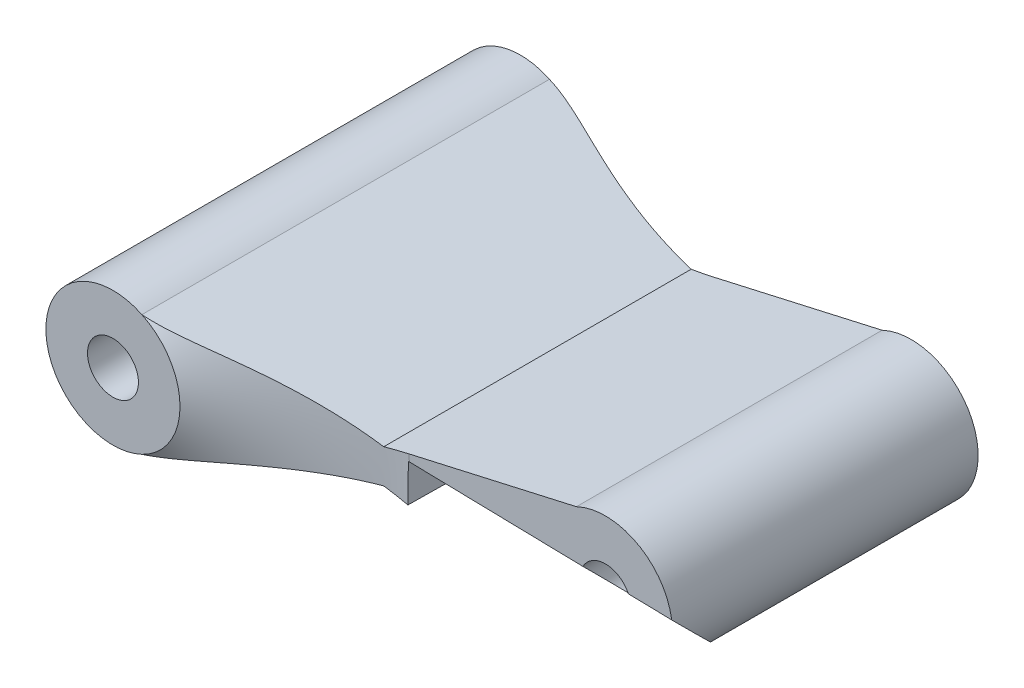
ISO-10303-21;
HEADER;
FILE_DESCRIPTION(('STEP AP214'),'2;1');
FILE_NAME('part.step','',(''),(''),'','','');
FILE_SCHEMA(('AUTOMOTIVE_DESIGN { 1 0 10303 214 1 1 1 1 }'));
ENDSEC;
DATA;
#1=APPLICATION_CONTEXT('core data for automotive mechanical design processes');
#2=APPLICATION_PROTOCOL_DEFINITION('international standard','automotive_design',2000,#1);
#3=PRODUCT_CONTEXT('',#1,'mechanical');
#4=PRODUCT('Part','Part','',(#3));
#5=PRODUCT_RELATED_PRODUCT_CATEGORY('part','',(#4));
#6=PRODUCT_DEFINITION_FORMATION('','',#4);
#7=PRODUCT_DEFINITION_CONTEXT('part definition',#1,'design');
#8=PRODUCT_DEFINITION('design','',#6,#7);
#9=PRODUCT_DEFINITION_SHAPE('','',#8);
#10=(LENGTH_UNIT() NAMED_UNIT(*) SI_UNIT(.MILLI.,.METRE.));
#11=(NAMED_UNIT(*) PLANE_ANGLE_UNIT() SI_UNIT($,.RADIAN.));
#12=(NAMED_UNIT(*) SI_UNIT($,.STERADIAN.) SOLID_ANGLE_UNIT());
#13=UNCERTAINTY_MEASURE_WITH_UNIT(LENGTH_MEASURE(1.E-05),#10,'distance_accuracy_value','');
#14=(GEOMETRIC_REPRESENTATION_CONTEXT(3) GLOBAL_UNCERTAINTY_ASSIGNED_CONTEXT((#13)) GLOBAL_UNIT_ASSIGNED_CONTEXT((#10,
#11,#12)) REPRESENTATION_CONTEXT('',''));
#15=CARTESIAN_POINT('',(0.,0.,0.));
#16=DIRECTION('',(0.,0.,1.));
#17=DIRECTION('',(1.,0.,0.));
#18=AXIS2_PLACEMENT_3D('',#15,#16,#17);
#19=CARTESIAN_POINT('',(0.318319944851648,1.40276585866828,9.));
#20=DIRECTION('',(-0.221296857654929,-0.975206491360704,0.));
#21=DIRECTION('',(0.975206491360704,-0.221296857654929,0.));
#22=AXIS2_PLACEMENT_3D('',#19,#20,#21);
#23=PLANE('',#22);
#24=DIRECTION('',(0.956277357625722,-0.217001400384298,-0.196071434746678));
#25=VECTOR('',#24,1.);
#26=CARTESIAN_POINT('',(0.372273808808155,1.39052248184738,9.27669348390134));
#27=LINE('',#26,#25);
#28=CARTESIAN_POINT('',(7.1979587305178,-0.158382942694425,7.87718127642713));
#29=VERTEX_POINT('',#28);
#30=CARTESIAN_POINT('',(12.1475499781939,-1.28155941812862,6.8623361066628));
#31=VERTEX_POINT('',#30);
#32=EDGE_CURVE('E310',#29,#31,#27,.T.);
#33=ORIENTED_EDGE('',*,*,#32,.F.);
#34=DIRECTION('',(-0.0108913560744962,0.00247150003228952,0.999937633080408));
#35=VECTOR('',#34,1.);
#36=CARTESIAN_POINT('',(7.18487237767981,-0.155413347242726,9.0786420121679));
#37=LINE('',#36,#35);
#38=CARTESIAN_POINT('',(7.18572854478782,-0.155607631317236,9.00003713453392));
#39=VERTEX_POINT('',#38);
#40=EDGE_CURVE('E133',#29,#39,#37,.T.);
#41=ORIENTED_EDGE('',*,*,#40,.T.);
#42=CARTESIAN_POINT('',(7.21253809260097,-0.161691336397913,9.));
#43=CARTESIAN_POINT('',(7.09362902021836,-0.134708123818783,9.00000580370716));
#44=CARTESIAN_POINT('',(6.97479628908164,-0.107742234830064,9.00219337229599));
#45=CARTESIAN_POINT('',(6.73728359165386,-0.0538451227214536,9.01093203620697));
#46=CARTESIAN_POINT('',(6.61860362525693,-0.0269138995775347,9.01748312850315));
#47=CARTESIAN_POINT('',(6.5,0.,9.02621598265502));
#48=B_SPLINE_CURVE_WITH_KNOTS('',3,(#42,#43,#44,#45,#46,#47),.UNSPECIFIED.,.F.,.F.,(4,2,4),(0.,
0.365620655231985,0.73124105691725),.UNSPECIFIED.);
#49=CARTESIAN_POINT('',(6.5,0.,9.02621598265502));
#50=VERTEX_POINT('',#49);
#51=EDGE_CURVE('E138',#39,#50,#48,.T.);
#52=ORIENTED_EDGE('',*,*,#51,.T.);
#53=DIRECTION('',(0.,0.,-1.));
#54=VECTOR('',#53,1.);
#55=CARTESIAN_POINT('',(6.5,0.,9.));
#56=LINE('',#55,#54);
#57=CARTESIAN_POINT('',(6.5,0.,-0.0262159826550194));
#58=VERTEX_POINT('',#57);
#59=EDGE_CURVE('E64',#50,#58,#56,.T.);
#60=ORIENTED_EDGE('',*,*,#59,.T.);
#61=CARTESIAN_POINT('',(6.5,0.,-0.0262159826550194));
#62=CARTESIAN_POINT('',(6.61860362525693,-0.0269138995775348,-0.0174831285031518));
#63=CARTESIAN_POINT('',(6.73728359165386,-0.0538451227214539,-0.0109320362069728));
#64=CARTESIAN_POINT('',(6.97479628908164,-0.107742234830065,-0.00219337229599346));
#65=CARTESIAN_POINT('',(7.09362902021837,-0.134708123818784,-5.80370716617859E-06));
#66=CARTESIAN_POINT('',(7.21253809260098,-0.161691336397914,0.));
#67=B_SPLINE_CURVE_WITH_KNOTS('',3,(#61,#62,#63,#64,#65,#66),.UNSPECIFIED.,.F.,.F.,(4,2,4),(0.,
0.365620401685268,0.731241056917255),.UNSPECIFIED.);
#68=CARTESIAN_POINT('',(7.21253809260098,-0.161691336397914,0.));
#69=VERTEX_POINT('',#68);
#70=EDGE_CURVE('E129',#58,#69,#67,.T.);
#71=ORIENTED_EDGE('',*,*,#70,.T.);
#72=DIRECTION('',(-0.975206491360704,0.221296857654929,0.));
#73=VECTOR('',#72,1.);
#74=CARTESIAN_POINT('',(0.318319944851648,1.40276585866828,0.));
#75=LINE('',#74,#73);
#76=CARTESIAN_POINT('',(12.1475499781939,-1.28155941812862,0.));
#77=VERTEX_POINT('',#76);
#78=EDGE_CURVE('E249',#77,#69,#75,.T.);
#79=ORIENTED_EDGE('',*,*,#78,.F.);
#80=DIRECTION('',(0.,0.,-1.));
#81=VECTOR('',#80,1.);
#82=CARTESIAN_POINT('',(12.1475499781939,-1.28155941812862,9.));
#83=LINE('',#82,#81);
#84=EDGE_CURVE('E276',#31,#77,#83,.T.);
#85=ORIENTED_EDGE('',*,*,#84,.F.);
#86=EDGE_LOOP('',(#33,#41,#52,#60,#71,#79,#85));
#87=FACE_BOUND('',#86,.T.);
#88=ADVANCED_FACE('F36',(#87),#23,.T.);
#89=CARTESIAN_POINT('',(0.,0.5,19.));
#90=DIRECTION('',(0.,0.,1.));
#91=DIRECTION('',(1.,0.,0.));
#92=AXIS2_PLACEMENT_3D('',#89,#90,#91);
#93=DEGENERATE_TOROIDAL_SURFACE('',#92,7.24282687642637,10.,.T.);
#94=CARTESIAN_POINT('',(7.1981587305178,0.983065076575513,9.00004054768263));
#95=CARTESIAN_POINT('',(7.19687752300153,0.865729791494417,9.00007048954901));
#96=CARTESIAN_POINT('',(7.19559635811303,0.748394489925287,9.00009651093696));
#97=CARTESIAN_POINT('',(7.19303426030841,0.513723966671679,9.00012738877503));
#98=CARTESIAN_POINT('',(7.19175332739212,0.396388744987204,9.00013224524045));
#99=CARTESIAN_POINT('',(7.18791109951056,0.0443836287972611,9.00009508143548));
#100=CARTESIAN_POINT('',(7.18535036979757,-0.19028623096475,9.00000132821181));
#101=CARTESIAN_POINT('',(7.18022687238521,-0.659627693542403,8.99999872471738));
#102=CARTESIAN_POINT('',(7.17766410467324,-0.894299296359792,9.00008987559906));
#103=CARTESIAN_POINT('',(7.17381212510018,-1.24630567003786,9.00094454704455));
#104=CARTESIAN_POINT('',(7.17252682543514,-1.36364112058816,9.00134909611676));
#105=CARTESIAN_POINT('',(7.16995215983244,-1.59831065674907,9.00253196168537));
#106=CARTESIAN_POINT('',(7.16866279387282,-1.71564474234885,9.00331028020443));
#107=CARTESIAN_POINT('',(7.16737067264849,-1.83297705458006,9.00434270800302));
#108=B_SPLINE_CURVE_WITH_KNOTS('',3,(#94,#95,#96,#97,#98,#99,#100,#101,#102,#103,#104,#105,#106,
#107),.UNSPECIFIED.,.F.,.F.,(4,2,2,2,2,2,4),(0.,0.352026879737172,0.704053505084873,
1.40810521332883,2.11216130971417,2.46419034446983,2.81622128427568),.UNSPECIFIED.);
#109=CARTESIAN_POINT('',(7.1979587305178,0.964748136813708,9.00004464121841));
#110=VERTEX_POINT('',#109);
#111=EDGE_CURVE('E11',#110,#39,#108,.T.);
#112=ORIENTED_EDGE('',*,*,#111,.F.);
#113=CARTESIAN_POINT('',(7.1977587305178,0.964753101955966,9.00004523861132));
#114=CARTESIAN_POINT('',(7.20530302589269,0.964565730857076,9.00002262548714));
#115=CARTESIAN_POINT('',(7.21284751907229,0.964386835374219,9.00000849027735));
#116=CARTESIAN_POINT('',(7.22793690104181,0.964045995640552,8.99999717568651));
#117=CARTESIAN_POINT('',(7.23548178983173,0.963884051389745,8.99999999630548));
#118=CARTESIAN_POINT('',(7.24302687642636,0.963730582754973,9.00001129483884));
#119=B_SPLINE_CURVE_WITH_KNOTS('',3,(#113,#114,#115,#116,#117,#118),.UNSPECIFIED.,.F.,.F.,(4,2,
4),(0.,0.0226398813295181,0.0452797626617358),.UNSPECIFIED.);
#120=CARTESIAN_POINT('',(7.22794576859043,0.964048626977582,9.));
#121=VERTEX_POINT('',#120);
#122=EDGE_CURVE('E49',#110,#121,#119,.T.);
#123=ORIENTED_EDGE('',*,*,#122,.T.);
#124=CARTESIAN_POINT('',(0.,0.5,9.));
#125=DIRECTION('',(0.,0.,1.));
#126=DIRECTION('',(1.,0.,0.));
#127=AXIS2_PLACEMENT_3D('',#124,#125,#126);
#128=CIRCLE('',#127,7.24282687642637);
#129=CARTESIAN_POINT('',(7.21253809260097,1.16169133639791,9.));
#130=VERTEX_POINT('',#129);
#131=EDGE_CURVE('E277',#130,#121,#128,.F.);
#132=ORIENTED_EDGE('',*,*,#131,.F.);
#133=CARTESIAN_POINT('',(6.5,0.999999999999998,9.02621598265502));
#134=CARTESIAN_POINT('',(6.61860362525693,1.02691389957753,9.01748312850315));
#135=CARTESIAN_POINT('',(6.73728359165386,1.05384512272145,9.01093203620697));
#136=CARTESIAN_POINT('',(6.97479628908164,1.10774223483006,9.00219337229599));
#137=CARTESIAN_POINT('',(7.09362902021836,1.13470812381878,9.00000580370716));
#138=CARTESIAN_POINT('',(7.21253809260097,1.16169133639791,9.));
#139=B_SPLINE_CURVE_WITH_KNOTS('',3,(#133,#134,#135,#136,#137,#138),.UNSPECIFIED.,.F.,.F.,(4,2,
4),(0.,0.365620401685265,0.73124105691725),.UNSPECIFIED.);
#140=CARTESIAN_POINT('',(6.5,0.999999999999999,9.02621598265502));
#141=VERTEX_POINT('',#140);
#142=EDGE_CURVE('E142',#141,#130,#139,.T.);
#143=ORIENTED_EDGE('',*,*,#142,.F.);
#144=CARTESIAN_POINT('',(0.852450021806109,2.28155941812861,10.5));
#145=CARTESIAN_POINT('',(0.93067139855769,2.26380918263499,10.489013320175));
#146=CARTESIAN_POINT('',(1.00845661573879,2.24615792181312,10.4752526889548));
#147=CARTESIAN_POINT('',(1.16304295947348,2.21107871304256,10.4432612052944));
#148=CARTESIAN_POINT('',(1.23984532344939,2.19365048429418,10.4250367097688));
#149=CARTESIAN_POINT('',(1.3922525573757,2.15906576582628,10.3852424649759));
#150=CARTESIAN_POINT('',(1.46786111939392,2.14190843829138,10.3636871978769));
#151=CARTESIAN_POINT('',(1.61839367035508,2.10774912865019,10.3181132888547));
#152=CARTESIAN_POINT('',(1.69331737882604,2.09074721018948,10.2940936829531));
#153=CARTESIAN_POINT('',(1.84242671802539,2.05691086014039,10.2444596039148));
#154=CARTESIAN_POINT('',(1.91661381271166,2.0400760963462,10.2188497028417));
#155=CARTESIAN_POINT('',(2.06464535783512,2.00648432264511,10.1666050123969));
#156=CARTESIAN_POINT('',(2.13848979238746,1.98972731634284,10.1399701760335));
#157=CARTESIAN_POINT('',(2.35997099872252,1.93946811952066,10.0592404408675));
#158=CARTESIAN_POINT('',(2.50734466318215,1.90602563412405,10.0043940216295));
#159=CARTESIAN_POINT('',(2.81015004351038,1.8373121055111,9.8927741900865));
#160=CARTESIAN_POINT('',(2.96559934775443,1.80203707108649,9.83605039886547));
#161=CARTESIAN_POINT('',(3.27756324862492,1.73124526281204,9.72575799777402));
#162=CARTESIAN_POINT('',(3.43407779120428,1.69572850122672,9.67218922913877));
#163=CARTESIAN_POINT('',(3.74832170951535,1.62441930437921,9.56969798683157));
#164=CARTESIAN_POINT('',(3.90604912240243,1.58862731453176,9.52076923524955));
#165=CARTESIAN_POINT('',(4.22303860274746,1.51669508629961,9.42846161269146));
#166=CARTESIAN_POINT('',(4.38230056499298,1.48055487179005,9.38508236409881));
#167=CARTESIAN_POINT('',(4.70254357669775,1.40788434221089,9.3045271619748));
#168=CARTESIAN_POINT('',(4.86352664691574,1.3713535685845,9.26735961417284));
#169=CARTESIAN_POINT('',(5.18684067684732,1.29798615410003,9.19982970867943));
#170=CARTESIAN_POINT('',(5.34917156318563,1.26114952989249,9.16946698301926));
#171=CARTESIAN_POINT('',(5.67575568761394,1.18704005550299,9.11581984356914));
#172=CARTESIAN_POINT('',(5.84001443160003,1.14976595590615,9.09257049329455));
#173=CARTESIAN_POINT('',(6.16942266715319,1.07501562553062,9.05363961691235));
#174=CARTESIAN_POINT('',(6.33457237269373,1.03753934619642,9.03795999877383));
#175=CARTESIAN_POINT('',(6.5,0.999999999999998,9.02621598265502));
#176=B_SPLINE_CURVE_WITH_KNOTS('',3,(#144,#145,#146,#147,#148,#149,#150,#151,#152,#153,#154,
#155,#156,#157,#158,#159,#160,#161,#162,#163,#164,#165,#166,#167,#168,#169,#170,#171,#172,#173,
#174,#175),.UNSPECIFIED.,.F.,.F.,(4,2,2,2,2,2,2,2,2,2,2,2,2,2,2,4),(0.,0.242733041900916,
0.485122401237104,0.7264860618196,0.967944499523185,1.20873829314252,1.44954314000396,
1.93183849596756,2.43940618117452,2.94694830305916,3.45379362250529,3.9606044352365,
4.46809561125668,4.97555933821833,5.48548560610094,5.99554033510277),.UNSPECIFIED.);
#177=CARTESIAN_POINT('',(0.852450021806109,2.28155941812861,10.5));
#178=VERTEX_POINT('',#177);
#179=EDGE_CURVE('E146',#178,#141,#176,.T.);
#180=ORIENTED_EDGE('',*,*,#179,.F.);
#181=CARTESIAN_POINT('',(0.,0.5,10.5));
#182=DIRECTION('',(0.,0.,1.));
#183=DIRECTION('',(1.,0.,0.));
#184=AXIS2_PLACEMENT_3D('',#181,#182,#183);
#185=CIRCLE('',#184,1.975);
#186=CARTESIAN_POINT('',(0.852450021806107,-1.28155941812861,10.5));
#187=VERTEX_POINT('',#186);
#188=EDGE_CURVE('E305',#187,#178,#185,.T.);
#189=ORIENTED_EDGE('',*,*,#188,.F.);
#190=CARTESIAN_POINT('',(6.5,0.,9.02621598265502));
#191=CARTESIAN_POINT('',(6.28388283576225,-0.0490419718847199,9.04153239081206));
#192=CARTESIAN_POINT('',(6.06826005973863,-0.0979717556746956,9.06360237120793));
#193=CARTESIAN_POINT('',(5.63858914168239,-0.19547400246438,9.12051815873685));
#194=CARTESIAN_POINT('',(5.42454120992051,-0.244046417748808,9.15536564142121));
#195=CARTESIAN_POINT('',(4.99938133302807,-0.340525005197476,9.23696282180518));
#196=CARTESIAN_POINT('',(4.78826191846441,-0.388432872348461,9.2836719638422));
#197=CARTESIAN_POINT('',(4.36866504364752,-0.483649086249216,9.38791847478578));
#198=CARTESIAN_POINT('',(4.16018680298897,-0.530957610090966,9.44545256157841));
#199=CARTESIAN_POINT('',(3.82363899823332,-0.607328073477823,9.54637852879663));
#200=CARTESIAN_POINT('',(3.69475834652267,-0.636574067519855,9.58697349255897));
#201=CARTESIAN_POINT('',(3.43794128515926,-0.694851785290784,9.67116479734663));
#202=CARTESIAN_POINT('',(3.31000483159243,-0.723883518984794,9.71476099779983));
#203=CARTESIAN_POINT('',(3.05486644111806,-0.78178030759244,9.80419934246881));
#204=CARTESIAN_POINT('',(2.9276646127107,-0.810645337884879,9.85004180941911));
#205=CARTESIAN_POINT('',(2.67363737498903,-0.868289980290952,9.94291378560176));
#206=CARTESIAN_POINT('',(2.54681208376513,-0.897069565607144,9.98994363065588));
#207=CARTESIAN_POINT('',(2.29194106176569,-0.954905682137786,10.0840523356766));
#208=CARTESIAN_POINT('',(2.16389422448594,-0.983962464443576,10.1311281315128));
#209=CARTESIAN_POINT('',(1.90699322881179,-1.04225922884656,10.2225599270788));
#210=CARTESIAN_POINT('',(1.77813987219392,-1.07149902900215,10.2669182637699));
#211=CARTESIAN_POINT('',(1.51826805670794,-1.13046994097781,10.3495986727011));
#212=CARTESIAN_POINT('',(1.38724625760249,-1.16020181077482,10.3879102404606));
#213=CARTESIAN_POINT('',(1.1885167752113,-1.20529811639436,10.437154775274));
#214=CARTESIAN_POINT('',(1.121798917167,-1.22043793802749,10.4522166369433));
#215=CARTESIAN_POINT('',(0.987643907184533,-1.25088080567736,10.4788836712219));
#216=CARTESIAN_POINT('',(0.920206086383874,-1.26618400347443,10.4904852748286));
#217=CARTESIAN_POINT('',(0.852450021806106,-1.28155941812861,10.5));
#218=B_SPLINE_CURVE_WITH_KNOTS('',3,(#190,#191,#192,#193,#194,#195,#196,#197,#198,#199,#200,
#201,#202,#203,#204,#205,#206,#207,#208,#209,#210,#211,#212,#213,#214,#215,#216,#217),
.UNSPECIFIED.,.F.,.F.,(4,2,2,2,2,2,2,2,2,2,2,2,2,4),(0.,0.666260771203592,1.33260894239821,
1.99670880601756,2.66060763866727,3.07532682935553,3.49002660859863,3.90478614594977,
4.31966433218776,4.73811447111591,5.15619954785824,5.57500311455566,5.78507852978281,
5.9953698789855),.UNSPECIFIED.);
#219=EDGE_CURVE('E141',#50,#187,#218,.T.);
#220=ORIENTED_EDGE('',*,*,#219,.F.);
#221=ORIENTED_EDGE('',*,*,#51,.F.);
#222=EDGE_LOOP('',(#112,#123,#132,#143,#180,#189,#220,#221));
#223=FACE_BOUND('',#222,.T.);
#224=ADVANCED_FACE('F136',(#223),#93,.F.);
#225=CARTESIAN_POINT('',(13.,0.5,9.));
#226=DIRECTION('',(0.,0.,-1.));
#227=DIRECTION('',(-1.,0.,0.));
#228=AXIS2_PLACEMENT_3D('',#225,#226,#227);
#229=CYLINDRICAL_SURFACE('',#228,1.97499999999999);
#230=CARTESIAN_POINT('',(13.,0.5,9.));
#231=DIRECTION('',(0.,0.,1.));
#232=DIRECTION('',(1.,0.,0.));
#233=AXIS2_PLACEMENT_3D('',#230,#231,#232);
#234=CIRCLE('',#233,1.97499999999999);
#235=CARTESIAN_POINT('',(14.9527906926657,0.795353196424537,9.));
#236=VERTEX_POINT('',#235);
#237=CARTESIAN_POINT('',(12.1475499781939,2.28155941812862,9.));
#238=VERTEX_POINT('',#237);
#239=EDGE_CURVE('E262',#236,#238,#234,.T.);
#240=ORIENTED_EDGE('',*,*,#239,.F.);
#241=CARTESIAN_POINT('',(13.,0.5,8.6620822597468));
#242=DIRECTION('',(0.0154381415529362,0.706938231944909,-0.707106781186545));
#243=DIRECTION('',(-0.0154381415529361,-0.706938231944905,-0.70710678118655));
#244=AXIS2_PLACEMENT_3D('',#241,#242,#243);
#245=ELLIPSE('',#244,2.79307178568686,1.97499999999999);
#246=EDGE_CURVE('E312',#236,#31,#245,.T.);
#247=ORIENTED_EDGE('',*,*,#246,.T.);
#248=ORIENTED_EDGE('',*,*,#84,.T.);
#249=CARTESIAN_POINT('',(13.,0.5,0.));
#250=DIRECTION('',(0.,0.,1.));
#251=DIRECTION('',(1.,0.,0.));
#252=AXIS2_PLACEMENT_3D('',#249,#250,#251);
#253=CIRCLE('',#252,1.97499999999999);
#254=CARTESIAN_POINT('',(12.1475499781939,2.28155941812862,0.));
#255=VERTEX_POINT('',#254);
#256=EDGE_CURVE('E259',#77,#255,#253,.T.);
#257=ORIENTED_EDGE('',*,*,#256,.T.);
#258=DIRECTION('',(0.,0.,-1.));
#259=VECTOR('',#258,1.);
#260=CARTESIAN_POINT('',(12.1475499781939,2.28155941812862,9.));
#261=LINE('',#260,#259);
#262=EDGE_CURVE('E256',#238,#255,#261,.T.);
#263=ORIENTED_EDGE('',*,*,#262,.F.);
#264=EDGE_LOOP('',(#240,#247,#248,#257,#263));
#265=FACE_BOUND('',#264,.T.);
#266=ADVANCED_FACE('F167',(#265),#229,.T.);
#267=CARTESIAN_POINT('',(0.102509812748837,-0.451738157876229,9.));
#268=DIRECTION('',(-0.221296857654929,0.975206491360704,0.));
#269=DIRECTION('',(-0.975206491360704,-0.221296857654929,0.));
#270=AXIS2_PLACEMENT_3D('',#267,#268,#269);
#271=PLANE('',#270);
#272=DIRECTION('',(0.975206491360704,0.221296857654929,0.));
#273=VECTOR('',#272,1.);
#274=CARTESIAN_POINT('',(0.102509812748837,-0.451738157876229,0.));
#275=LINE('',#274,#273);
#276=CARTESIAN_POINT('',(7.21253809260098,1.16169133639791,0.));
#277=VERTEX_POINT('',#276);
#278=EDGE_CURVE('E246',#277,#255,#275,.T.);
#279=ORIENTED_EDGE('',*,*,#278,.F.);
#280=CARTESIAN_POINT('',(7.21253809260098,1.16169133639791,0.));
#281=CARTESIAN_POINT('',(7.09362902021837,1.13470812381878,-5.80370716557285E-06));
#282=CARTESIAN_POINT('',(6.97479628908164,1.10774223483006,-0.00219337229599296));
#283=CARTESIAN_POINT('',(6.73728359165386,1.05384512272145,-0.0109320362069725));
#284=CARTESIAN_POINT('',(6.61860362525693,1.02691389957753,-0.0174831285031516));
#285=CARTESIAN_POINT('',(6.5,0.999999999999998,-0.0262159826550194));
#286=B_SPLINE_CURVE_WITH_KNOTS('',3,(#280,#281,#282,#283,#284,#285),.UNSPECIFIED.,.F.,.F.,(4,2,
4),(0.,0.365620655231987,0.731241056917255),.UNSPECIFIED.);
#287=CARTESIAN_POINT('',(6.5,0.999999999999999,-0.0262159826550194));
#288=VERTEX_POINT('',#287);
#289=EDGE_CURVE('E235',#277,#288,#286,.T.);
#290=ORIENTED_EDGE('',*,*,#289,.T.);
#291=DIRECTION('',(0.,0.,-1.));
#292=VECTOR('',#291,1.);
#293=CARTESIAN_POINT('',(6.5,0.999999999999999,9.));
#294=LINE('',#293,#292);
#295=EDGE_CURVE('E273',#141,#288,#294,.T.);
#296=ORIENTED_EDGE('',*,*,#295,.F.);
#297=ORIENTED_EDGE('',*,*,#142,.T.);
#298=DIRECTION('',(0.975206491360704,0.221296857654929,0.));
#299=VECTOR('',#298,1.);
#300=CARTESIAN_POINT('',(0.102509812748837,-0.451738157876229,9.));
#301=LINE('',#300,#299);
#302=EDGE_CURVE('E269',#130,#238,#301,.T.);
#303=ORIENTED_EDGE('',*,*,#302,.T.);
#304=ORIENTED_EDGE('',*,*,#262,.T.);
#305=EDGE_LOOP('',(#279,#290,#296,#297,#303,#304));
#306=FACE_BOUND('',#305,.T.);
#307=ADVANCED_FACE('F221',(#306),#271,.T.);
#308=CARTESIAN_POINT('',(0.534130076954461,2.35379355946033,9.));
#309=DIRECTION('',(0.221296857654929,0.975206491360704,0.));
#310=DIRECTION('',(-0.975206491360704,0.221296857654929,0.));
#311=AXIS2_PLACEMENT_3D('',#308,#309,#310);
#312=PLANE('',#311);
#313=ORIENTED_EDGE('',*,*,#295,.T.);
#314=CARTESIAN_POINT('',(6.5,0.999999999999998,-0.0262159826550195));
#315=CARTESIAN_POINT('',(6.28388283576225,1.04904197188472,-0.0415323908120649));
#316=CARTESIAN_POINT('',(6.06826005973863,1.09797175567469,-0.0636023712079342));
#317=CARTESIAN_POINT('',(5.63858914168239,1.19547400246438,-0.12051815873685));
#318=CARTESIAN_POINT('',(5.42454120992051,1.24404641774881,-0.155365641421206));
#319=CARTESIAN_POINT('',(4.99938133302807,1.34052500519747,-0.236962821805178));
#320=CARTESIAN_POINT('',(4.78826191846441,1.38843287234846,-0.2836719638422));
#321=CARTESIAN_POINT('',(4.36866504364752,1.48364908624921,-0.387918474785779));
#322=CARTESIAN_POINT('',(4.16018680298897,1.53095761009096,-0.445452561578415));
#323=CARTESIAN_POINT('',(3.82363899823332,1.60732807347782,-0.546378528796633));
#324=CARTESIAN_POINT('',(3.69475834652267,1.63657406751985,-0.586973492558969));
#325=CARTESIAN_POINT('',(3.43794128515926,1.69485178529078,-0.671164797346628));
#326=CARTESIAN_POINT('',(3.31000483159243,1.72388351898479,-0.714760997799837));
#327=CARTESIAN_POINT('',(3.05486644111806,1.78178030759244,-0.804199342468813));
#328=CARTESIAN_POINT('',(2.9276646127107,1.81064533788488,-0.85004180941911));
#329=CARTESIAN_POINT('',(2.67363737498903,1.86828998029095,-0.942913785601758));
#330=CARTESIAN_POINT('',(2.54681208376513,1.89706956560714,-0.989943630655884));
#331=CARTESIAN_POINT('',(2.29194106176569,1.95490568213778,-1.08405233567662));
#332=CARTESIAN_POINT('',(2.16389422448594,1.98396246444357,-1.13112813151277));
#333=CARTESIAN_POINT('',(1.90699322881179,2.04225922884655,-1.2225599270788));
#334=CARTESIAN_POINT('',(1.77813987219392,2.07149902900215,-1.26691826376989));
#335=CARTESIAN_POINT('',(1.51826805670794,2.13046994097781,-1.34959867270107));
#336=CARTESIAN_POINT('',(1.38724625760249,2.16020181077482,-1.38791024046064));
#337=CARTESIAN_POINT('',(1.18851677521131,2.20529811639436,-1.43715477527402));
#338=CARTESIAN_POINT('',(1.121798917167,2.22043793802749,-1.45221663694333));
#339=CARTESIAN_POINT('',(0.987643907184536,2.25088080567736,-1.47888367122189));
#340=CARTESIAN_POINT('',(0.920206086383877,2.26618400347443,-1.49048527482865));
#341=CARTESIAN_POINT('',(0.852450021806109,2.28155941812861,-1.5));
#342=B_SPLINE_CURVE_WITH_KNOTS('',3,(#314,#315,#316,#317,#318,#319,#320,#321,#322,#323,#324,
#325,#326,#327,#328,#329,#330,#331,#332,#333,#334,#335,#336,#337,#338,#339,#340,#341),
.UNSPECIFIED.,.F.,.F.,(4,2,2,2,2,2,2,2,2,2,2,2,2,4),(0.,0.666260771203593,1.33260894239821,
1.99670880601756,2.66060763866727,3.07532682935553,3.49002660859863,3.90478614594977,
4.31966433218776,4.73811447111591,5.15619954785824,5.57500311455566,5.78507852978281,
5.9953698789855),.UNSPECIFIED.);
#343=CARTESIAN_POINT('',(0.852450021806109,2.28155941812861,-1.5));
#344=VERTEX_POINT('',#343);
#345=EDGE_CURVE('E229',#288,#344,#342,.T.);
#346=ORIENTED_EDGE('',*,*,#345,.T.);
#347=DIRECTION('',(0.,0.,-1.));
#348=VECTOR('',#347,1.);
#349=CARTESIAN_POINT('',(0.852450021806109,2.28155941812861,9.));
#350=LINE('',#349,#348);
#351=EDGE_CURVE('E271',#178,#344,#350,.T.);
#352=ORIENTED_EDGE('',*,*,#351,.F.);
#353=ORIENTED_EDGE('',*,*,#179,.T.);
#354=EDGE_LOOP('',(#313,#346,#352,#353));
#355=FACE_BOUND('',#354,.T.);
#356=ADVANCED_FACE('F217',(#355),#312,.T.);
#357=CARTESIAN_POINT('',(0.,0.5,9.));
#358=DIRECTION('',(0.,0.,-1.));
#359=DIRECTION('',(-1.,0.,0.));
#360=AXIS2_PLACEMENT_3D('',#357,#358,#359);
#361=CYLINDRICAL_SURFACE('',#360,1.975);
#362=ORIENTED_EDGE('',*,*,#351,.T.);
#363=CARTESIAN_POINT('',(0.,0.5,-1.5));
#364=DIRECTION('',(0.,0.,1.));
#365=DIRECTION('',(1.,0.,0.));
#366=AXIS2_PLACEMENT_3D('',#363,#364,#365);
#367=CIRCLE('',#366,1.975);
#368=CARTESIAN_POINT('',(0.852450021806107,-1.28155941812861,-1.5));
#369=VERTEX_POINT('',#368);
#370=EDGE_CURVE('E290',#344,#369,#367,.T.);
#371=ORIENTED_EDGE('',*,*,#370,.T.);
#372=DIRECTION('',(0.,0.,-1.));
#373=VECTOR('',#372,1.);
#374=CARTESIAN_POINT('',(0.852450021806107,-1.28155941812861,9.));
#375=LINE('',#374,#373);
#376=EDGE_CURVE('E268',#187,#369,#375,.T.);
#377=ORIENTED_EDGE('',*,*,#376,.F.);
#378=EDGE_CURVE('E302',#178,#187,#185,.T.);
#379=ORIENTED_EDGE('',*,*,#378,.F.);
#380=EDGE_LOOP('',(#362,#371,#377,#379));
#381=FACE_BOUND('',#380,.T.);
#382=ADVANCED_FACE('F212',(#381),#361,.T.);
#383=CARTESIAN_POINT('',(0.318319944851648,-1.40276585866828,9.));
#384=DIRECTION('',(-0.221296857654929,0.975206491360704,0.));
#385=DIRECTION('',(-0.975206491360704,-0.221296857654929,0.));
#386=AXIS2_PLACEMENT_3D('',#383,#384,#385);
#387=PLANE('',#386);
#388=ORIENTED_EDGE('',*,*,#376,.T.);
#389=CARTESIAN_POINT('',(0.852450021806107,-1.28155941812861,-1.5));
#390=CARTESIAN_POINT('',(0.930671398557688,-1.26380918263499,-1.48901332017499));
#391=CARTESIAN_POINT('',(1.00845661573879,-1.24615792181312,-1.47525268895477));
#392=CARTESIAN_POINT('',(1.16304295947347,-1.21107871304256,-1.44326120529436));
#393=CARTESIAN_POINT('',(1.23984532344938,-1.19365048429418,-1.42503670976883));
#394=CARTESIAN_POINT('',(1.3922525573757,-1.15906576582628,-1.3852424649759));
#395=CARTESIAN_POINT('',(1.46786111939392,-1.14190843829138,-1.36368719787693));
#396=CARTESIAN_POINT('',(1.61839367035508,-1.10774912865019,-1.31811328885473));
#397=CARTESIAN_POINT('',(1.69331737882603,-1.09074721018948,-1.29409368295307));
#398=CARTESIAN_POINT('',(1.84242671802538,-1.05691086014039,-1.24445960391482));
#399=CARTESIAN_POINT('',(1.91661381271165,-1.0400760963462,-1.21884970284168));
#400=CARTESIAN_POINT('',(2.06464535783511,-1.00648432264511,-1.16660501239695));
#401=CARTESIAN_POINT('',(2.13848979238746,-0.989727316342846,-1.13997017603352));
#402=CARTESIAN_POINT('',(2.35997099872252,-0.93946811952066,-1.05924044086747));
#403=CARTESIAN_POINT('',(2.50734466318214,-0.906025634124053,-1.00439402162951));
#404=CARTESIAN_POINT('',(2.81015004351038,-0.837312105511107,-0.892774190086501));
#405=CARTESIAN_POINT('',(2.96559934775443,-0.802037071086495,-0.836050398865476));
#406=CARTESIAN_POINT('',(3.27756324862492,-0.731245262812038,-0.725757997774019));
#407=CARTESIAN_POINT('',(3.43407779120428,-0.695728501226722,-0.672189229138778));
#408=CARTESIAN_POINT('',(3.74832170951534,-0.624419304379211,-0.569697986831567));
#409=CARTESIAN_POINT('',(3.90604912240243,-0.588627314531757,-0.520769235249549));
#410=CARTESIAN_POINT('',(4.22303860274746,-0.516695086299615,-0.428461612691467));
#411=CARTESIAN_POINT('',(4.38230056499297,-0.480554871790056,-0.385082364098814));
#412=CARTESIAN_POINT('',(4.70254357669775,-0.407884342210895,-0.304527161974803));
#413=CARTESIAN_POINT('',(4.86352664691574,-0.371353568584505,-0.267359614172834));
#414=CARTESIAN_POINT('',(5.18684067684732,-0.297986154100032,-0.199829708679428));
#415=CARTESIAN_POINT('',(5.34917156318563,-0.261149529892491,-0.169466983019265));
#416=CARTESIAN_POINT('',(5.67575568761394,-0.187040055502991,-0.11581984356914));
#417=CARTESIAN_POINT('',(5.84001443160003,-0.149765955906148,-0.0925704932945513));
#418=CARTESIAN_POINT('',(6.1694226671532,-0.0750156255306212,-0.0536396169123491));
#419=CARTESIAN_POINT('',(6.33457237269373,-0.0375393461964237,-0.0379599987738291));
#420=CARTESIAN_POINT('',(6.5,0.,-0.0262159826550204));
#421=B_SPLINE_CURVE_WITH_KNOTS('',3,(#389,#390,#391,#392,#393,#394,#395,#396,#397,#398,#399,
#400,#401,#402,#403,#404,#405,#406,#407,#408,#409,#410,#411,#412,#413,#414,#415,#416,#417,#418,
#419,#420),.UNSPECIFIED.,.F.,.F.,(4,2,2,2,2,2,2,2,2,2,2,2,2,2,2,4),(0.,0.242733041900916,
0.485122401237102,0.726486061819597,0.967944499523181,1.20873829314251,1.44954314000396,
1.93183849596756,2.43940618117452,2.94694830305916,3.45379362250529,3.9606044352365,
4.46809561125669,4.97555933821833,5.48548560610094,5.99554033510277),.UNSPECIFIED.);
#422=EDGE_CURVE('E175',#369,#58,#421,.T.);
#423=ORIENTED_EDGE('',*,*,#422,.T.);
#424=ORIENTED_EDGE('',*,*,#59,.F.);
#425=ORIENTED_EDGE('',*,*,#219,.T.);
#426=EDGE_LOOP('',(#388,#423,#424,#425));
#427=FACE_BOUND('',#426,.T.);
#428=ADVANCED_FACE('F208',(#427),#387,.F.);
#429=CARTESIAN_POINT('',(13.,0.5,9.));
#430=DIRECTION('',(0.,0.,-1.));
#431=DIRECTION('',(-1.,0.,0.));
#432=AXIS2_PLACEMENT_3D('',#429,#430,#431);
#433=CYLINDRICAL_SURFACE('',#432,0.750000000000002);
#434=CARTESIAN_POINT('',(13.,0.5,8.6620822597468));
#435=DIRECTION('',(0.0154381415529362,0.706938231944909,-0.707106781186545));
#436=DIRECTION('',(-0.0154381415529361,-0.706938231944905,-0.70710678118655));
#437=AXIS2_PLACEMENT_3D('',#434,#435,#436);
#438=ELLIPSE('',#437,1.06066017177983,0.750000000000002);
#439=CARTESIAN_POINT('',(13.6767788528491,0.82321878710297,9.));
#440=VERTEX_POINT('',#439);
#441=CARTESIAN_POINT('',(12.3379765477385,0.852455598133591,9.));
#442=VERTEX_POINT('',#441);
#443=EDGE_CURVE('E316',#440,#442,#438,.T.);
#444=ORIENTED_EDGE('',*,*,#443,.F.);
#445=CARTESIAN_POINT('',(13.,0.5,9.));
#446=DIRECTION('',(0.,0.,1.));
#447=DIRECTION('',(1.,0.,0.));
#448=AXIS2_PLACEMENT_3D('',#445,#446,#447);
#449=CIRCLE('',#448,0.750000000000002);
#450=EDGE_CURVE('E258',#440,#442,#449,.T.);
#451=ORIENTED_EDGE('',*,*,#450,.T.);
#452=EDGE_LOOP('',(#444,#451));
#453=FACE_BOUND('',#452,.T.);
#454=CARTESIAN_POINT('',(13.,0.5,0.));
#455=DIRECTION('',(0.,0.,1.));
#456=DIRECTION('',(1.,0.,0.));
#457=AXIS2_PLACEMENT_3D('',#454,#455,#456);
#458=CIRCLE('',#457,0.750000000000002);
#459=CARTESIAN_POINT('',(13.75,0.5,0.));
#460=VERTEX_POINT('',#459);
#461=EDGE_CURVE('E288',#460,#460,#458,.T.);
#462=ORIENTED_EDGE('',*,*,#461,.F.);
#463=EDGE_LOOP('',(#462));
#464=FACE_BOUND('',#463,.T.);
#465=ADVANCED_FACE('F168',(#453,#464),#433,.F.);
#466=CARTESIAN_POINT('',(0.,0.,9.));
#467=DIRECTION('',(0.,0.,1.));
#468=DIRECTION('',(1.,0.,0.));
#469=AXIS2_PLACEMENT_3D('',#466,#467,#468);
#470=PLANE('',#469);
#471=DIRECTION('',(-0.999761635376545,0.021832829161998,0.));
#472=VECTOR('',#471,1.);
#473=CARTESIAN_POINT('',(0.0244882543675252,1.12135798124632,9.));
#474=LINE('',#473,#472);
#475=EDGE_CURVE('E315',#236,#440,#474,.T.);
#476=ORIENTED_EDGE('',*,*,#475,.F.);
#477=ORIENTED_EDGE('',*,*,#239,.T.);
#478=ORIENTED_EDGE('',*,*,#302,.F.);
#479=ORIENTED_EDGE('',*,*,#131,.T.);
#480=EDGE_CURVE('E56',#442,#121,#474,.T.);
#481=ORIENTED_EDGE('',*,*,#480,.F.);
#482=ORIENTED_EDGE('',*,*,#450,.F.);
#483=EDGE_LOOP('',(#476,#477,#478,#479,#481,#482));
#484=FACE_BOUND('',#483,.T.);
#485=ADVANCED_FACE('F199',(#484),#470,.T.);
#486=CARTESIAN_POINT('',(0.,0.,0.));
#487=DIRECTION('',(0.,0.,1.));
#488=DIRECTION('',(1.,0.,0.));
#489=AXIS2_PLACEMENT_3D('',#486,#487,#488);
#490=PLANE('',#489);
#491=ORIENTED_EDGE('',*,*,#461,.T.);
#492=EDGE_LOOP('',(#491));
#493=FACE_BOUND('',#492,.T.);
#494=ORIENTED_EDGE('',*,*,#78,.T.);
#495=CARTESIAN_POINT('',(0.,0.5,0.));
#496=DIRECTION('',(0.,0.,1.));
#497=DIRECTION('',(1.,0.,0.));
#498=AXIS2_PLACEMENT_3D('',#495,#496,#497);
#499=CIRCLE('',#498,7.24282687642637);
#500=EDGE_CURVE('E144',#69,#277,#499,.T.);
#501=ORIENTED_EDGE('',*,*,#500,.T.);
#502=ORIENTED_EDGE('',*,*,#278,.T.);
#503=ORIENTED_EDGE('',*,*,#256,.F.);
#504=EDGE_LOOP('',(#494,#501,#502,#503));
#505=FACE_BOUND('',#504,.T.);
#506=ADVANCED_FACE('F197',(#493,#505),#490,.F.);
#507=CARTESIAN_POINT('',(0.,0.5,-1.5));
#508=DIRECTION('',(0.,0.,1.));
#509=DIRECTION('',(1.,0.,0.));
#510=AXIS2_PLACEMENT_3D('',#507,#508,#509);
#511=PLANE('',#510);
#512=CARTESIAN_POINT('',(0.,0.5,-1.5));
#513=DIRECTION('',(0.,0.,1.));
#514=DIRECTION('',(1.,0.,0.));
#515=AXIS2_PLACEMENT_3D('',#512,#513,#514);
#516=CIRCLE('',#515,0.75);
#517=CARTESIAN_POINT('',(0.75,0.5,-1.5));
#518=VERTEX_POINT('',#517);
#519=EDGE_CURVE('E298',#518,#518,#516,.T.);
#520=ORIENTED_EDGE('',*,*,#519,.T.);
#521=EDGE_LOOP('',(#520));
#522=FACE_BOUND('',#521,.T.);
#523=ORIENTED_EDGE('',*,*,#370,.F.);
#524=EDGE_CURVE('E293',#369,#344,#367,.T.);
#525=ORIENTED_EDGE('',*,*,#524,.F.);
#526=EDGE_LOOP('',(#523,#525));
#527=FACE_BOUND('',#526,.T.);
#528=ADVANCED_FACE('F194',(#522,#527),#511,.F.);
#529=CARTESIAN_POINT('',(0.,0.5,9.));
#530=DIRECTION('',(0.,0.,-1.));
#531=DIRECTION('',(-1.,0.,0.));
#532=AXIS2_PLACEMENT_3D('',#529,#530,#531);
#533=CYLINDRICAL_SURFACE('',#532,0.75);
#534=ORIENTED_EDGE('',*,*,#519,.F.);
#535=EDGE_LOOP('',(#534));
#536=FACE_BOUND('',#535,.T.);
#537=CARTESIAN_POINT('',(0.,0.5,10.5));
#538=DIRECTION('',(0.,0.,1.));
#539=DIRECTION('',(1.,0.,0.));
#540=AXIS2_PLACEMENT_3D('',#537,#538,#539);
#541=CIRCLE('',#540,0.75);
#542=CARTESIAN_POINT('',(0.75,0.5,10.5));
#543=VERTEX_POINT('',#542);
#544=EDGE_CURVE('E306',#543,#543,#541,.T.);
#545=ORIENTED_EDGE('',*,*,#544,.T.);
#546=EDGE_LOOP('',(#545));
#547=FACE_BOUND('',#546,.T.);
#548=ADVANCED_FACE('F192',(#536,#547),#533,.F.);
#549=CARTESIAN_POINT('',(0.,0.5,10.5));
#550=DIRECTION('',(0.,0.,1.));
#551=DIRECTION('',(1.,0.,0.));
#552=AXIS2_PLACEMENT_3D('',#549,#550,#551);
#553=PLANE('',#552);
#554=ORIENTED_EDGE('',*,*,#378,.T.);
#555=ORIENTED_EDGE('',*,*,#188,.T.);
#556=EDGE_LOOP('',(#554,#555));
#557=FACE_BOUND('',#556,.T.);
#558=ORIENTED_EDGE('',*,*,#544,.F.);
#559=EDGE_LOOP('',(#558));
#560=FACE_BOUND('',#559,.T.);
#561=ADVANCED_FACE('F189',(#557,#560),#553,.T.);
#562=CARTESIAN_POINT('',(0.,0.5,-10.));
#563=DIRECTION('',(0.,0.,1.));
#564=DIRECTION('',(1.,0.,0.));
#565=AXIS2_PLACEMENT_3D('',#562,#563,#564);
#566=DEGENERATE_TOROIDAL_SURFACE('',#565,7.24282687642637,10.,.T.);
#567=ORIENTED_EDGE('',*,*,#422,.F.);
#568=ORIENTED_EDGE('',*,*,#524,.T.);
#569=ORIENTED_EDGE('',*,*,#345,.F.);
#570=ORIENTED_EDGE('',*,*,#289,.F.);
#571=ORIENTED_EDGE('',*,*,#500,.F.);
#572=ORIENTED_EDGE('',*,*,#70,.F.);
#573=EDGE_LOOP('',(#567,#568,#569,#570,#571,#572));
#574=FACE_BOUND('',#573,.T.);
#575=ADVANCED_FACE('F38',(#574),#566,.F.);
#576=CARTESIAN_POINT('',(7.08989173964725,-8.96633074256266,8.96846850818154));
#577=DIRECTION('',(0.999880824791331,-0.0109151133048538,0.010917715702046));
#578=DIRECTION('',(0.0109183661268435,0.,-0.999940392864055));
#579=AXIS2_PLACEMENT_3D('',#576,#577,#578);
#580=PLANE('',#579);
#581=DIRECTION('',(0.,-0.707191060828789,-0.707022491497868));
#582=VECTOR('',#581,1.);
#583=CARTESIAN_POINT('',(7.1979587305178,-4.0177631189483,4.01872103987572));
#584=LINE('',#583,#582);
#585=EDGE_CURVE('E123',#110,#29,#584,.T.);
#586=ORIENTED_EDGE('',*,*,#585,.F.);
#587=ORIENTED_EDGE('',*,*,#111,.T.);
#588=ORIENTED_EDGE('',*,*,#40,.F.);
#589=EDGE_LOOP('',(#586,#587,#588));
#590=FACE_BOUND('',#589,.T.);
#591=ADVANCED_FACE('F131',(#590),#580,.T.);
#592=CARTESIAN_POINT('',(-0.0860036040452283,-3.93824836857129,3.93918733147625));
#593=DIRECTION('',(0.0154381415529362,0.706938231944909,-0.707106781186545));
#594=DIRECTION('',(0.,0.707191060828789,0.707022491497868));
#595=AXIS2_PLACEMENT_3D('',#592,#593,#594);
#596=PLANE('',#595);
#597=ORIENTED_EDGE('',*,*,#32,.T.);
#598=ORIENTED_EDGE('',*,*,#246,.F.);
#599=ORIENTED_EDGE('',*,*,#475,.T.);
#600=ORIENTED_EDGE('',*,*,#443,.T.);
#601=ORIENTED_EDGE('',*,*,#480,.T.);
#602=ORIENTED_EDGE('',*,*,#122,.F.);
#603=ORIENTED_EDGE('',*,*,#585,.T.);
#604=EDGE_LOOP('',(#597,#598,#599,#600,#601,#602,#603));
#605=FACE_BOUND('',#604,.T.);
#606=ADVANCED_FACE('F122',(#605),#596,.F.);
#607=CLOSED_SHELL('',(#88,#224,#266,#307,#356,#382,#428,#465,#485,#506,#528,#548,#561,#575,#591,#606));
#608=MANIFOLD_SOLID_BREP('B2',#607);
#609=ADVANCED_BREP_SHAPE_REPRESENTATION('',(#18,#608),#14);
#610=SHAPE_DEFINITION_REPRESENTATION(#9,#609);
ENDSEC;
END-ISO-10303-21;
